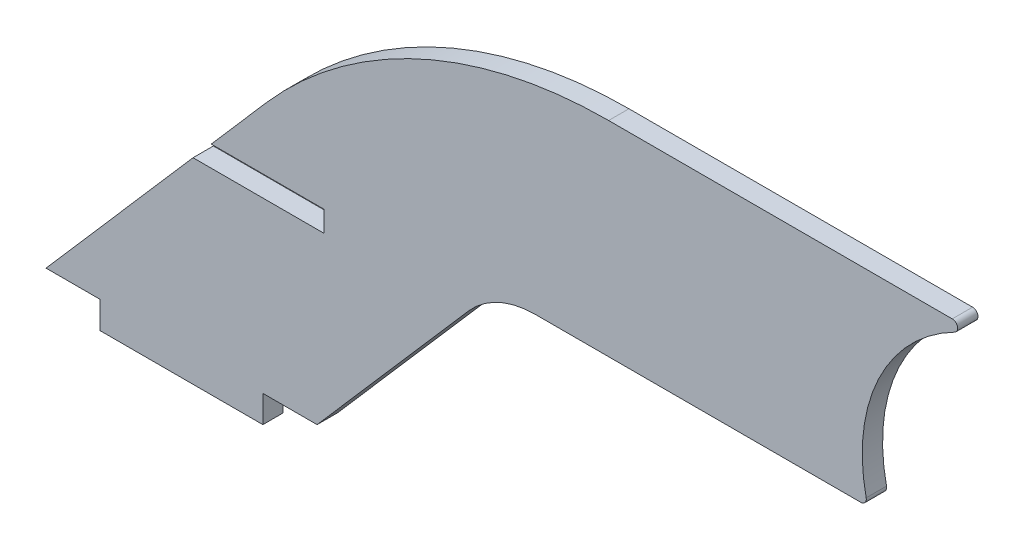
ISO-10303-21;
HEADER;
FILE_DESCRIPTION(('STEP AP214'),'2;1');
FILE_NAME('part.step','',(''),(''),'','','');
FILE_SCHEMA(('AUTOMOTIVE_DESIGN { 1 0 10303 214 1 1 1 1 }'));
ENDSEC;
DATA;
#1=APPLICATION_CONTEXT('core data for automotive mechanical design processes');
#2=APPLICATION_PROTOCOL_DEFINITION('international standard','automotive_design',2000,#1);
#3=PRODUCT_CONTEXT('',#1,'mechanical');
#4=PRODUCT('Part','Part','',(#3));
#5=PRODUCT_RELATED_PRODUCT_CATEGORY('part','',(#4));
#6=PRODUCT_DEFINITION_FORMATION('','',#4);
#7=PRODUCT_DEFINITION_CONTEXT('part definition',#1,'design');
#8=PRODUCT_DEFINITION('design','',#6,#7);
#9=PRODUCT_DEFINITION_SHAPE('','',#8);
#10=(LENGTH_UNIT() NAMED_UNIT(*) SI_UNIT(.MILLI.,.METRE.));
#11=(NAMED_UNIT(*) PLANE_ANGLE_UNIT() SI_UNIT($,.RADIAN.));
#12=(NAMED_UNIT(*) SI_UNIT($,.STERADIAN.) SOLID_ANGLE_UNIT());
#13=UNCERTAINTY_MEASURE_WITH_UNIT(LENGTH_MEASURE(1.E-05),#10,'distance_accuracy_value','');
#14=(GEOMETRIC_REPRESENTATION_CONTEXT(3) GLOBAL_UNCERTAINTY_ASSIGNED_CONTEXT((#13)) GLOBAL_UNIT_ASSIGNED_CONTEXT((#10,
#11,#12)) REPRESENTATION_CONTEXT('',''));
#15=CARTESIAN_POINT('',(0.,0.,0.));
#16=DIRECTION('',(0.,0.,1.));
#17=DIRECTION('',(1.,0.,0.));
#18=AXIS2_PLACEMENT_3D('',#15,#16,#17);
#19=CARTESIAN_POINT('',(-13.3722671470838,11.6243344854956,3.));
#20=DIRECTION('',(-0.754709580222773,0.656059028990506,0.));
#21=DIRECTION('',(-0.656059028990506,-0.754709580222773,0.));
#22=AXIS2_PLACEMENT_3D('',#19,#20,#21);
#23=PLANE('',#22);
#24=DIRECTION('',(0.,0.,-1.));
#25=VECTOR('',#24,1.);
#26=CARTESIAN_POINT('',(4.37480012836689,32.04,3.));
#27=LINE('',#26,#25);
#28=CARTESIAN_POINT('',(4.37480012836689,32.04,3.));
#29=VERTEX_POINT('',#28);
#30=CARTESIAN_POINT('',(4.37480012836689,32.04,0.));
#31=VERTEX_POINT('',#30);
#32=EDGE_CURVE('E187',#29,#31,#27,.T.);
#33=ORIENTED_EDGE('',*,*,#32,.F.);
#34=DIRECTION('',(0.656059028990506,0.754709580222773,0.));
#35=VECTOR('',#34,1.);
#36=CARTESIAN_POINT('',(-13.3722671470838,11.6243344854956,3.));
#37=LINE('',#36,#35);
#38=CARTESIAN_POINT('',(12.4528395649979,41.3327213601858,3.));
#39=VERTEX_POINT('',#38);
#40=EDGE_CURVE('E304',#29,#39,#37,.T.);
#41=ORIENTED_EDGE('',*,*,#40,.T.);
#42=DIRECTION('',(0.,0.,-1.));
#43=VECTOR('',#42,1.);
#44=CARTESIAN_POINT('',(12.4528395649979,41.3327213601858,3.));
#45=LINE('',#44,#43);
#46=CARTESIAN_POINT('',(12.4528395649979,41.3327213601858,0.));
#47=VERTEX_POINT('',#46);
#48=EDGE_CURVE('E230',#39,#47,#45,.T.);
#49=ORIENTED_EDGE('',*,*,#48,.T.);
#50=DIRECTION('',(0.656059028990506,0.754709580222773,0.));
#51=VECTOR('',#50,1.);
#52=CARTESIAN_POINT('',(-13.3722671470838,11.6243344854956,0.));
#53=LINE('',#52,#51);
#54=EDGE_CURVE('E208',#31,#47,#53,.T.);
#55=ORIENTED_EDGE('',*,*,#54,.F.);
#56=EDGE_LOOP('',(#33,#41,#49,#55));
#57=FACE_BOUND('',#56,.T.);
#58=ADVANCED_FACE('F40',(#57),#23,.T.);
#59=CARTESIAN_POINT('',(9.41119487211756,-8.18102688933583,3.));
#60=DIRECTION('',(0.754709580222773,-0.656059028990505,0.));
#61=DIRECTION('',(0.656059028990506,0.754709580222774,0.));
#62=AXIS2_PLACEMENT_3D('',#59,#60,#61);
#63=PLANE('',#62);
#64=DIRECTION('',(-0.656059028990506,-0.754709580222774,0.));
#65=VECTOR('',#64,1.);
#66=CARTESIAN_POINT('',(9.41119487211756,-8.18102688933583,0.));
#67=LINE('',#66,#65);
#68=CARTESIAN_POINT('',(42.3541724835962,29.7155337946984,0.));
#69=VERTEX_POINT('',#68);
#70=CARTESIAN_POINT('',(20.,4.,0.));
#71=VERTEX_POINT('',#70);
#72=EDGE_CURVE('E183',#69,#71,#67,.T.);
#73=ORIENTED_EDGE('',*,*,#72,.F.);
#74=DIRECTION('',(0.,0.,-1.));
#75=VECTOR('',#74,1.);
#76=CARTESIAN_POINT('',(42.3541724835962,29.7155337946984,3.));
#77=LINE('',#76,#75);
#78=CARTESIAN_POINT('',(42.3541724835962,29.7155337946984,3.));
#79=VERTEX_POINT('',#78);
#80=EDGE_CURVE('E48',#79,#69,#77,.T.);
#81=ORIENTED_EDGE('',*,*,#80,.F.);
#82=DIRECTION('',(-0.656059028990506,-0.754709580222774,0.));
#83=VECTOR('',#82,1.);
#84=CARTESIAN_POINT('',(9.41119487211756,-8.18102688933583,3.));
#85=LINE('',#84,#83);
#86=CARTESIAN_POINT('',(20.,4.,3.));
#87=VERTEX_POINT('',#86);
#88=EDGE_CURVE('E221',#79,#87,#85,.T.);
#89=ORIENTED_EDGE('',*,*,#88,.T.);
#90=DIRECTION('',(0.,0.,-1.));
#91=VECTOR('',#90,1.);
#92=CARTESIAN_POINT('',(20.,4.,3.));
#93=LINE('',#92,#91);
#94=EDGE_CURVE('E116',#87,#71,#93,.T.);
#95=ORIENTED_EDGE('',*,*,#94,.T.);
#96=EDGE_LOOP('',(#73,#81,#89,#95));
#97=FACE_BOUND('',#96,.T.);
#98=ADVANCED_FACE('F42',(#97),#63,.T.);
#99=CARTESIAN_POINT('',(52.1653970264923,21.1867664178219,3.));
#100=DIRECTION('',(0.,0.,-1.));
#101=DIRECTION('',(-1.,0.,0.));
#102=AXIS2_PLACEMENT_3D('',#99,#100,#101);
#103=CYLINDRICAL_SURFACE('',#102,13.);
#104=CARTESIAN_POINT('',(52.1653970264923,21.1867664178219,0.));
#105=DIRECTION('',(0.,0.,1.));
#106=DIRECTION('',(1.,0.,0.));
#107=AXIS2_PLACEMENT_3D('',#104,#105,#106);
#108=CIRCLE('',#107,13.);
#109=CARTESIAN_POINT('',(52.1653970264923,34.1867664178219,0.));
#110=VERTEX_POINT('',#109);
#111=EDGE_CURVE('E186',#69,#110,#108,.F.);
#112=ORIENTED_EDGE('',*,*,#111,.T.);
#113=DIRECTION('',(0.,0.,-1.));
#114=VECTOR('',#113,1.);
#115=CARTESIAN_POINT('',(52.1653970264923,34.1867664178219,3.));
#116=LINE('',#115,#114);
#117=CARTESIAN_POINT('',(52.1653970264923,34.1867664178219,3.));
#118=VERTEX_POINT('',#117);
#119=EDGE_CURVE('E243',#118,#110,#116,.T.);
#120=ORIENTED_EDGE('',*,*,#119,.F.);
#121=CARTESIAN_POINT('',(52.1653970264923,21.1867664178219,3.));
#122=DIRECTION('',(0.,0.,1.));
#123=DIRECTION('',(1.,0.,0.));
#124=AXIS2_PLACEMENT_3D('',#121,#122,#123);
#125=CIRCLE('',#124,13.);
#126=EDGE_CURVE('E248',#79,#118,#125,.F.);
#127=ORIENTED_EDGE('',*,*,#126,.F.);
#128=ORIENTED_EDGE('',*,*,#80,.T.);
#129=EDGE_LOOP('',(#112,#120,#127,#128));
#130=FACE_BOUND('',#129,.T.);
#131=ADVANCED_FACE('F246',(#130),#103,.F.);
#132=CARTESIAN_POINT('',(0.,34.1867664178219,3.));
#133=DIRECTION('',(0.,-1.,0.));
#134=DIRECTION('',(1.,0.,0.));
#135=AXIS2_PLACEMENT_3D('',#132,#133,#134);
#136=PLANE('',#135);
#137=DIRECTION('',(-1.,0.,0.));
#138=VECTOR('',#137,1.);
#139=CARTESIAN_POINT('',(0.,34.1867664178219,0.));
#140=LINE('',#139,#138);
#141=CARTESIAN_POINT('',(100.240955704569,34.1867664178219,0.));
#142=VERTEX_POINT('',#141);
#143=EDGE_CURVE('E190',#142,#110,#140,.T.);
#144=ORIENTED_EDGE('',*,*,#143,.F.);
#145=DIRECTION('',(0.,0.,-1.));
#146=VECTOR('',#145,1.);
#147=CARTESIAN_POINT('',(100.240955704569,34.1867664178219,3.));
#148=LINE('',#147,#146);
#149=CARTESIAN_POINT('',(100.240955704569,34.1867664178219,3.));
#150=VERTEX_POINT('',#149);
#151=EDGE_CURVE('E241',#150,#142,#148,.T.);
#152=ORIENTED_EDGE('',*,*,#151,.F.);
#153=DIRECTION('',(-1.,0.,0.));
#154=VECTOR('',#153,1.);
#155=CARTESIAN_POINT('',(0.,34.1867664178219,3.));
#156=LINE('',#155,#154);
#157=EDGE_CURVE('E320',#150,#118,#156,.T.);
#158=ORIENTED_EDGE('',*,*,#157,.T.);
#159=ORIENTED_EDGE('',*,*,#119,.T.);
#160=EDGE_LOOP('',(#144,#152,#158,#159));
#161=FACE_BOUND('',#160,.T.);
#162=ADVANCED_FACE('F259',(#161),#136,.T.);
#163=CARTESIAN_POINT('',(100.240955704569,34.9867664178219,3.));
#164=DIRECTION('',(0.,0.,-1.));
#165=DIRECTION('',(-1.,0.,0.));
#166=AXIS2_PLACEMENT_3D('',#163,#164,#165);
#167=CYLINDRICAL_SURFACE('',#166,0.80000000000001);
#168=CARTESIAN_POINT('',(100.240955704569,34.9867664178219,0.));
#169=DIRECTION('',(0.,0.,1.));
#170=DIRECTION('',(1.,0.,0.));
#171=AXIS2_PLACEMENT_3D('',#168,#169,#170);
#172=CIRCLE('',#171,0.80000000000001);
#173=CARTESIAN_POINT('',(101.022385069884,35.158137789479,0.));
#174=VERTEX_POINT('',#173);
#175=EDGE_CURVE('E193',#174,#142,#172,.F.);
#176=ORIENTED_EDGE('',*,*,#175,.F.);
#177=DIRECTION('',(0.,0.,-1.));
#178=VECTOR('',#177,1.);
#179=CARTESIAN_POINT('',(101.022385069884,35.158137789479,3.));
#180=LINE('',#179,#178);
#181=CARTESIAN_POINT('',(101.022385069884,35.158137789479,3.));
#182=VERTEX_POINT('',#181);
#183=EDGE_CURVE('E239',#182,#174,#180,.T.);
#184=ORIENTED_EDGE('',*,*,#183,.F.);
#185=CARTESIAN_POINT('',(100.240955704569,34.9867664178219,3.));
#186=DIRECTION('',(0.,0.,1.));
#187=DIRECTION('',(1.,0.,0.));
#188=AXIS2_PLACEMENT_3D('',#185,#186,#187);
#189=CIRCLE('',#188,0.80000000000001);
#190=EDGE_CURVE('E317',#182,#150,#189,.F.);
#191=ORIENTED_EDGE('',*,*,#190,.T.);
#192=ORIENTED_EDGE('',*,*,#151,.T.);
#193=EDGE_LOOP('',(#176,#184,#191,#192));
#194=FACE_BOUND('',#193,.T.);
#195=ADVANCED_FACE('F374',(#194),#167,.T.);
#196=CARTESIAN_POINT('',(125.534640711315,40.5337981602553,3.));
#197=DIRECTION('',(0.,0.,-1.));
#198=DIRECTION('',(-1.,0.,0.));
#199=AXIS2_PLACEMENT_3D('',#196,#197,#198);
#200=CYLINDRICAL_SURFACE('',#199,25.0947883245268);
#201=CARTESIAN_POINT('',(125.534640711315,40.5337981602553,0.));
#202=DIRECTION('',(0.,0.,1.));
#203=DIRECTION('',(1.,0.,0.));
#204=AXIS2_PLACEMENT_3D('',#201,#202,#203);
#205=CIRCLE('',#204,25.0947883245268);
#206=CARTESIAN_POINT('',(114.085991202061,62.8648712528557,0.));
#207=VERTEX_POINT('',#206);
#208=EDGE_CURVE('E196',#207,#174,#205,.T.);
#209=ORIENTED_EDGE('',*,*,#208,.F.);
#210=DIRECTION('',(0.,0.,-1.));
#211=VECTOR('',#210,1.);
#212=CARTESIAN_POINT('',(114.085991202061,62.8648712528557,3.));
#213=LINE('',#212,#211);
#214=CARTESIAN_POINT('',(114.085991202061,62.8648712528557,3.));
#215=VERTEX_POINT('',#214);
#216=EDGE_CURVE('E237',#215,#207,#213,.T.);
#217=ORIENTED_EDGE('',*,*,#216,.F.);
#218=CARTESIAN_POINT('',(125.534640711315,40.5337981602553,3.));
#219=DIRECTION('',(0.,0.,1.));
#220=DIRECTION('',(1.,0.,0.));
#221=AXIS2_PLACEMENT_3D('',#218,#219,#220);
#222=CIRCLE('',#221,25.0947883245268);
#223=EDGE_CURVE('E314',#215,#182,#222,.T.);
#224=ORIENTED_EDGE('',*,*,#223,.T.);
#225=ORIENTED_EDGE('',*,*,#183,.T.);
#226=EDGE_LOOP('',(#209,#217,#224,#225));
#227=FACE_BOUND('',#226,.T.);
#228=ADVANCED_FACE('F370',(#227),#200,.F.);
#229=CARTESIAN_POINT('',(113.721018224845,63.5767664178219,3.));
#230=DIRECTION('',(0.,0.,-1.));
#231=DIRECTION('',(-1.,0.,0.));
#232=AXIS2_PLACEMENT_3D('',#229,#230,#231);
#233=CYLINDRICAL_SURFACE('',#232,0.799999999999995);
#234=CARTESIAN_POINT('',(113.721018224845,63.5767664178219,0.));
#235=DIRECTION('',(0.,0.,1.));
#236=DIRECTION('',(1.,0.,0.));
#237=AXIS2_PLACEMENT_3D('',#234,#235,#236);
#238=CIRCLE('',#237,0.799999999999995);
#239=CARTESIAN_POINT('',(113.721018224845,64.3767664178219,0.));
#240=VERTEX_POINT('',#239);
#241=EDGE_CURVE('E199',#240,#207,#238,.F.);
#242=ORIENTED_EDGE('',*,*,#241,.F.);
#243=DIRECTION('',(0.,0.,-1.));
#244=VECTOR('',#243,1.);
#245=CARTESIAN_POINT('',(113.721018224845,64.3767664178219,3.));
#246=LINE('',#245,#244);
#247=CARTESIAN_POINT('',(113.721018224845,64.3767664178219,3.));
#248=VERTEX_POINT('',#247);
#249=EDGE_CURVE('E235',#248,#240,#246,.T.);
#250=ORIENTED_EDGE('',*,*,#249,.F.);
#251=CARTESIAN_POINT('',(113.721018224845,63.5767664178219,3.));
#252=DIRECTION('',(0.,0.,1.));
#253=DIRECTION('',(1.,0.,0.));
#254=AXIS2_PLACEMENT_3D('',#251,#252,#253);
#255=CIRCLE('',#254,0.799999999999995);
#256=EDGE_CURVE('E311',#248,#215,#255,.F.);
#257=ORIENTED_EDGE('',*,*,#256,.T.);
#258=ORIENTED_EDGE('',*,*,#216,.T.);
#259=EDGE_LOOP('',(#242,#250,#257,#258));
#260=FACE_BOUND('',#259,.T.);
#261=ADVANCED_FACE('F366',(#260),#233,.T.);
#262=CARTESIAN_POINT('',(0.,64.3767664178219,3.));
#263=DIRECTION('',(0.,1.,0.));
#264=DIRECTION('',(-1.,0.,0.));
#265=AXIS2_PLACEMENT_3D('',#262,#263,#264);
#266=PLANE('',#265);
#267=DIRECTION('',(1.,0.,0.));
#268=VECTOR('',#267,1.);
#269=CARTESIAN_POINT('',(0.,64.3767664178219,0.));
#270=LINE('',#269,#268);
#271=CARTESIAN_POINT('',(63.0183814399237,64.3767664178219,0.));
#272=VERTEX_POINT('',#271);
#273=EDGE_CURVE('E202',#272,#240,#270,.T.);
#274=ORIENTED_EDGE('',*,*,#273,.F.);
#275=DIRECTION('',(0.,0.,-1.));
#276=VECTOR('',#275,1.);
#277=CARTESIAN_POINT('',(63.0183814399237,64.3767664178219,3.));
#278=LINE('',#277,#276);
#279=CARTESIAN_POINT('',(63.0183814399237,64.3767664178219,3.));
#280=VERTEX_POINT('',#279);
#281=EDGE_CURVE('E233',#280,#272,#278,.T.);
#282=ORIENTED_EDGE('',*,*,#281,.F.);
#283=DIRECTION('',(1.,0.,0.));
#284=VECTOR('',#283,1.);
#285=CARTESIAN_POINT('',(0.,64.3767664178219,3.));
#286=LINE('',#285,#284);
#287=EDGE_CURVE('E308',#280,#248,#286,.T.);
#288=ORIENTED_EDGE('',*,*,#287,.T.);
#289=ORIENTED_EDGE('',*,*,#249,.T.);
#290=EDGE_LOOP('',(#274,#282,#288,#289));
#291=FACE_BOUND('',#290,.T.);
#292=ADVANCED_FACE('F278',(#291),#266,.T.);
#293=CARTESIAN_POINT('',(63.0183814399237,-2.62323358217814,3.));
#294=DIRECTION('',(0.,0.,-1.));
#295=DIRECTION('',(-1.,0.,0.));
#296=AXIS2_PLACEMENT_3D('',#293,#294,#295);
#297=CYLINDRICAL_SURFACE('',#296,67.);
#298=CARTESIAN_POINT('',(63.0183814399237,-2.62323358217814,0.));
#299=DIRECTION('',(0.,0.,1.));
#300=DIRECTION('',(1.,0.,0.));
#301=AXIS2_PLACEMENT_3D('',#298,#299,#300);
#302=CIRCLE('',#301,67.);
#303=EDGE_CURVE('E205',#272,#47,#302,.T.);
#304=ORIENTED_EDGE('',*,*,#303,.T.);
#305=ORIENTED_EDGE('',*,*,#48,.F.);
#306=CARTESIAN_POINT('',(63.0183814399237,-2.62323358217814,3.));
#307=DIRECTION('',(0.,0.,1.));
#308=DIRECTION('',(1.,0.,0.));
#309=AXIS2_PLACEMENT_3D('',#306,#307,#308);
#310=CIRCLE('',#309,67.);
#311=EDGE_CURVE('E305',#280,#39,#310,.T.);
#312=ORIENTED_EDGE('',*,*,#311,.F.);
#313=ORIENTED_EDGE('',*,*,#281,.T.);
#314=EDGE_LOOP('',(#304,#305,#312,#313));
#315=FACE_BOUND('',#314,.T.);
#316=ADVANCED_FACE('F270',(#315),#297,.T.);
#317=DIRECTION('',(0.,0.,1.));
#318=VECTOR('',#317,1.);
#319=CARTESIAN_POINT('',(1.69739697589292,28.96,3.));
#320=LINE('',#319,#318);
#321=CARTESIAN_POINT('',(1.69739697589293,28.96,0.));
#322=VERTEX_POINT('',#321);
#323=CARTESIAN_POINT('',(1.69739697589293,28.96,3.));
#324=VERTEX_POINT('',#323);
#325=EDGE_CURVE('E285',#322,#324,#320,.T.);
#326=ORIENTED_EDGE('',*,*,#325,.F.);
#327=CARTESIAN_POINT('',(-20.,4.,0.));
#328=VERTEX_POINT('',#327);
#329=EDGE_CURVE('E209',#328,#322,#53,.T.);
#330=ORIENTED_EDGE('',*,*,#329,.F.);
#331=DIRECTION('',(0.,0.,-1.));
#332=VECTOR('',#331,1.);
#333=CARTESIAN_POINT('',(-20.,4.,3.));
#334=LINE('',#333,#332);
#335=CARTESIAN_POINT('',(-20.,4.,3.));
#336=VERTEX_POINT('',#335);
#337=EDGE_CURVE('E228',#336,#328,#334,.T.);
#338=ORIENTED_EDGE('',*,*,#337,.F.);
#339=EDGE_CURVE('E288',#336,#324,#37,.T.);
#340=ORIENTED_EDGE('',*,*,#339,.T.);
#341=EDGE_LOOP('',(#326,#330,#338,#340));
#342=FACE_BOUND('',#341,.T.);
#343=ADVANCED_FACE('F262',(#342),#23,.T.);
#344=CARTESIAN_POINT('',(0.,4.,3.));
#345=DIRECTION('',(0.,1.,0.));
#346=DIRECTION('',(-1.,0.,0.));
#347=AXIS2_PLACEMENT_3D('',#344,#345,#346);
#348=PLANE('',#347);
#349=DIRECTION('',(1.,0.,0.));
#350=VECTOR('',#349,1.);
#351=CARTESIAN_POINT('',(0.,4.,0.));
#352=LINE('',#351,#350);
#353=CARTESIAN_POINT('',(-12.,4.,0.));
#354=VERTEX_POINT('',#353);
#355=EDGE_CURVE('E212',#328,#354,#352,.T.);
#356=ORIENTED_EDGE('',*,*,#355,.T.);
#357=DIRECTION('',(0.,0.,-1.));
#358=VECTOR('',#357,1.);
#359=CARTESIAN_POINT('',(-12.,4.,3.));
#360=LINE('',#359,#358);
#361=CARTESIAN_POINT('',(-12.,4.,3.));
#362=VERTEX_POINT('',#361);
#363=EDGE_CURVE('E225',#362,#354,#360,.T.);
#364=ORIENTED_EDGE('',*,*,#363,.F.);
#365=DIRECTION('',(1.,0.,0.));
#366=VECTOR('',#365,1.);
#367=CARTESIAN_POINT('',(0.,4.,3.));
#368=LINE('',#367,#366);
#369=EDGE_CURVE('E300',#336,#362,#368,.T.);
#370=ORIENTED_EDGE('',*,*,#369,.F.);
#371=ORIENTED_EDGE('',*,*,#337,.T.);
#372=EDGE_LOOP('',(#356,#364,#370,#371));
#373=FACE_BOUND('',#372,.T.);
#374=ADVANCED_FACE('F269',(#373),#348,.F.);
#375=CARTESIAN_POINT('',(-12.,0.,3.));
#376=DIRECTION('',(1.,0.,0.));
#377=DIRECTION('',(0.,1.,0.));
#378=AXIS2_PLACEMENT_3D('',#375,#376,#377);
#379=PLANE('',#378);
#380=DIRECTION('',(0.,-1.,0.));
#381=VECTOR('',#380,1.);
#382=CARTESIAN_POINT('',(-12.,0.,0.));
#383=LINE('',#382,#381);
#384=CARTESIAN_POINT('',(-12.,0.,0.));
#385=VERTEX_POINT('',#384);
#386=EDGE_CURVE('E214',#354,#385,#383,.T.);
#387=ORIENTED_EDGE('',*,*,#386,.T.);
#388=DIRECTION('',(0.,0.,-1.));
#389=VECTOR('',#388,1.);
#390=CARTESIAN_POINT('',(-12.,0.,3.));
#391=LINE('',#390,#389);
#392=CARTESIAN_POINT('',(-12.,0.,3.));
#393=VERTEX_POINT('',#392);
#394=EDGE_CURVE('E175',#393,#385,#391,.T.);
#395=ORIENTED_EDGE('',*,*,#394,.F.);
#396=DIRECTION('',(0.,-1.,0.));
#397=VECTOR('',#396,1.);
#398=CARTESIAN_POINT('',(-12.,0.,3.));
#399=LINE('',#398,#397);
#400=EDGE_CURVE('E162',#362,#393,#399,.T.);
#401=ORIENTED_EDGE('',*,*,#400,.F.);
#402=ORIENTED_EDGE('',*,*,#363,.T.);
#403=EDGE_LOOP('',(#387,#395,#401,#402));
#404=FACE_BOUND('',#403,.T.);
#405=ADVANCED_FACE('F276',(#404),#379,.F.);
#406=CARTESIAN_POINT('',(0.,0.,3.));
#407=DIRECTION('',(0.,1.,0.));
#408=DIRECTION('',(0.,0.,1.));
#409=AXIS2_PLACEMENT_3D('',#406,#407,#408);
#410=PLANE('',#409);
#411=DIRECTION('',(1.,0.,0.));
#412=VECTOR('',#411,1.);
#413=CARTESIAN_POINT('',(0.,0.,0.));
#414=LINE('',#413,#412);
#415=CARTESIAN_POINT('',(12.,0.,0.));
#416=VERTEX_POINT('',#415);
#417=EDGE_CURVE('E171',#385,#416,#414,.T.);
#418=ORIENTED_EDGE('',*,*,#417,.T.);
#419=DIRECTION('',(0.,0.,-1.));
#420=VECTOR('',#419,1.);
#421=CARTESIAN_POINT('',(12.,0.,3.));
#422=LINE('',#421,#420);
#423=CARTESIAN_POINT('',(12.,0.,3.));
#424=VERTEX_POINT('',#423);
#425=EDGE_CURVE('E168',#424,#416,#422,.T.);
#426=ORIENTED_EDGE('',*,*,#425,.F.);
#427=DIRECTION('',(1.,0.,0.));
#428=VECTOR('',#427,1.);
#429=CARTESIAN_POINT('',(0.,0.,3.));
#430=LINE('',#429,#428);
#431=EDGE_CURVE('E155',#393,#424,#430,.T.);
#432=ORIENTED_EDGE('',*,*,#431,.F.);
#433=ORIENTED_EDGE('',*,*,#394,.T.);
#434=EDGE_LOOP('',(#418,#426,#432,#433));
#435=FACE_BOUND('',#434,.T.);
#436=ADVANCED_FACE('F169',(#435),#410,.F.);
#437=CARTESIAN_POINT('',(12.,0.,3.));
#438=DIRECTION('',(1.,0.,0.));
#439=DIRECTION('',(0.,1.,0.));
#440=AXIS2_PLACEMENT_3D('',#437,#438,#439);
#441=PLANE('',#440);
#442=DIRECTION('',(0.,-1.,0.));
#443=VECTOR('',#442,1.);
#444=CARTESIAN_POINT('',(12.,0.,0.));
#445=LINE('',#444,#443);
#446=CARTESIAN_POINT('',(12.,4.,0.));
#447=VERTEX_POINT('',#446);
#448=EDGE_CURVE('E217',#447,#416,#445,.T.);
#449=ORIENTED_EDGE('',*,*,#448,.F.);
#450=DIRECTION('',(0.,0.,-1.));
#451=VECTOR('',#450,1.);
#452=CARTESIAN_POINT('',(12.,4.,3.));
#453=LINE('',#452,#451);
#454=CARTESIAN_POINT('',(12.,4.,3.));
#455=VERTEX_POINT('',#454);
#456=EDGE_CURVE('E176',#455,#447,#453,.T.);
#457=ORIENTED_EDGE('',*,*,#456,.F.);
#458=DIRECTION('',(0.,-1.,0.));
#459=VECTOR('',#458,1.);
#460=CARTESIAN_POINT('',(12.,0.,3.));
#461=LINE('',#460,#459);
#462=EDGE_CURVE('E160',#455,#424,#461,.T.);
#463=ORIENTED_EDGE('',*,*,#462,.T.);
#464=ORIENTED_EDGE('',*,*,#425,.T.);
#465=EDGE_LOOP('',(#449,#457,#463,#464));
#466=FACE_BOUND('',#465,.T.);
#467=ADVANCED_FACE('F178',(#466),#441,.T.);
#468=CARTESIAN_POINT('',(0.,4.,3.));
#469=DIRECTION('',(0.,1.,0.));
#470=DIRECTION('',(-1.,0.,0.));
#471=AXIS2_PLACEMENT_3D('',#468,#469,#470);
#472=PLANE('',#471);
#473=DIRECTION('',(1.,0.,0.));
#474=VECTOR('',#473,1.);
#475=CARTESIAN_POINT('',(0.,4.,0.));
#476=LINE('',#475,#474);
#477=EDGE_CURVE('E219',#447,#71,#476,.T.);
#478=ORIENTED_EDGE('',*,*,#477,.T.);
#479=ORIENTED_EDGE('',*,*,#94,.F.);
#480=DIRECTION('',(1.,0.,0.));
#481=VECTOR('',#480,1.);
#482=CARTESIAN_POINT('',(0.,4.,3.));
#483=LINE('',#482,#481);
#484=EDGE_CURVE('E64',#455,#87,#483,.T.);
#485=ORIENTED_EDGE('',*,*,#484,.F.);
#486=ORIENTED_EDGE('',*,*,#456,.T.);
#487=EDGE_LOOP('',(#478,#479,#485,#486));
#488=FACE_BOUND('',#487,.T.);
#489=ADVANCED_FACE('F434',(#488),#472,.F.);
#490=CARTESIAN_POINT('',(0.,0.,3.));
#491=DIRECTION('',(0.,0.,1.));
#492=DIRECTION('',(1.,0.,0.));
#493=AXIS2_PLACEMENT_3D('',#490,#491,#492);
#494=PLANE('',#493);
#495=DIRECTION('',(-1.,0.,0.));
#496=VECTOR('',#495,1.);
#497=CARTESIAN_POINT('',(21.,32.04,3.));
#498=LINE('',#497,#496);
#499=CARTESIAN_POINT('',(21.,32.04,3.));
#500=VERTEX_POINT('',#499);
#501=EDGE_CURVE('E331',#500,#29,#498,.T.);
#502=ORIENTED_EDGE('',*,*,#501,.F.);
#503=DIRECTION('',(0.,1.,0.));
#504=VECTOR('',#503,1.);
#505=CARTESIAN_POINT('',(21.,28.96,3.));
#506=LINE('',#505,#504);
#507=CARTESIAN_POINT('',(21.,28.96,3.));
#508=VERTEX_POINT('',#507);
#509=EDGE_CURVE('E336',#508,#500,#506,.T.);
#510=ORIENTED_EDGE('',*,*,#509,.F.);
#511=DIRECTION('',(1.,0.,0.));
#512=VECTOR('',#511,1.);
#513=CARTESIAN_POINT('',(-10.5413350567153,28.96,3.));
#514=LINE('',#513,#512);
#515=EDGE_CURVE('E339',#324,#508,#514,.T.);
#516=ORIENTED_EDGE('',*,*,#515,.F.);
#517=ORIENTED_EDGE('',*,*,#339,.F.);
#518=ORIENTED_EDGE('',*,*,#369,.T.);
#519=ORIENTED_EDGE('',*,*,#400,.T.);
#520=ORIENTED_EDGE('',*,*,#431,.T.);
#521=ORIENTED_EDGE('',*,*,#462,.F.);
#522=ORIENTED_EDGE('',*,*,#484,.T.);
#523=ORIENTED_EDGE('',*,*,#88,.F.);
#524=ORIENTED_EDGE('',*,*,#126,.T.);
#525=ORIENTED_EDGE('',*,*,#157,.F.);
#526=ORIENTED_EDGE('',*,*,#190,.F.);
#527=ORIENTED_EDGE('',*,*,#223,.F.);
#528=ORIENTED_EDGE('',*,*,#256,.F.);
#529=ORIENTED_EDGE('',*,*,#287,.F.);
#530=ORIENTED_EDGE('',*,*,#311,.T.);
#531=ORIENTED_EDGE('',*,*,#40,.F.);
#532=EDGE_LOOP('',(#502,#510,#516,#517,#518,#519,#520,#521,#522,#523,#524,#525,#526,#527,#528,
#529,#530,#531));
#533=FACE_BOUND('',#532,.T.);
#534=ADVANCED_FACE('F158',(#533),#494,.T.);
#535=CARTESIAN_POINT('',(0.,0.,0.));
#536=DIRECTION('',(0.,0.,1.));
#537=DIRECTION('',(1.,0.,0.));
#538=AXIS2_PLACEMENT_3D('',#535,#536,#537);
#539=PLANE('',#538);
#540=DIRECTION('',(0.,-1.,0.));
#541=VECTOR('',#540,1.);
#542=CARTESIAN_POINT('',(21.,28.96,0.));
#543=LINE('',#542,#541);
#544=CARTESIAN_POINT('',(21.,32.04,0.));
#545=VERTEX_POINT('',#544);
#546=CARTESIAN_POINT('',(21.,28.96,0.));
#547=VERTEX_POINT('',#546);
#548=EDGE_CURVE('E328',#545,#547,#543,.T.);
#549=ORIENTED_EDGE('',*,*,#548,.F.);
#550=DIRECTION('',(-1.,0.,0.));
#551=VECTOR('',#550,1.);
#552=CARTESIAN_POINT('',(0.,32.04,0.));
#553=LINE('',#552,#551);
#554=EDGE_CURVE('E11',#545,#31,#553,.T.);
#555=ORIENTED_EDGE('',*,*,#554,.T.);
#556=ORIENTED_EDGE('',*,*,#54,.T.);
#557=ORIENTED_EDGE('',*,*,#303,.F.);
#558=ORIENTED_EDGE('',*,*,#273,.T.);
#559=ORIENTED_EDGE('',*,*,#241,.T.);
#560=ORIENTED_EDGE('',*,*,#208,.T.);
#561=ORIENTED_EDGE('',*,*,#175,.T.);
#562=ORIENTED_EDGE('',*,*,#143,.T.);
#563=ORIENTED_EDGE('',*,*,#111,.F.);
#564=ORIENTED_EDGE('',*,*,#72,.T.);
#565=ORIENTED_EDGE('',*,*,#477,.F.);
#566=ORIENTED_EDGE('',*,*,#448,.T.);
#567=ORIENTED_EDGE('',*,*,#417,.F.);
#568=ORIENTED_EDGE('',*,*,#386,.F.);
#569=ORIENTED_EDGE('',*,*,#355,.F.);
#570=ORIENTED_EDGE('',*,*,#329,.T.);
#571=DIRECTION('',(-1.,0.,0.));
#572=VECTOR('',#571,1.);
#573=CARTESIAN_POINT('',(-10.5413350567153,28.96,0.));
#574=LINE('',#573,#572);
#575=EDGE_CURVE('E292',#547,#322,#574,.T.);
#576=ORIENTED_EDGE('',*,*,#575,.F.);
#577=EDGE_LOOP('',(#549,#555,#556,#557,#558,#559,#560,#561,#562,#563,#564,#565,#566,#567,#568,
#569,#570,#576));
#578=FACE_BOUND('',#577,.T.);
#579=ADVANCED_FACE('F251',(#578),#539,.F.);
#580=CARTESIAN_POINT('',(21.,32.04,-31.6913587143242));
#581=DIRECTION('',(0.,1.,0.));
#582=DIRECTION('',(0.,0.,1.));
#583=AXIS2_PLACEMENT_3D('',#580,#581,#582);
#584=PLANE('',#583);
#585=ORIENTED_EDGE('',*,*,#32,.T.);
#586=ORIENTED_EDGE('',*,*,#554,.F.);
#587=DIRECTION('',(0.,0.,1.));
#588=VECTOR('',#587,1.);
#589=CARTESIAN_POINT('',(21.,32.04,-31.6913587143242));
#590=LINE('',#589,#588);
#591=EDGE_CURVE('E330',#545,#500,#590,.T.);
#592=ORIENTED_EDGE('',*,*,#591,.T.);
#593=ORIENTED_EDGE('',*,*,#501,.T.);
#594=EDGE_LOOP('',(#585,#586,#592,#593));
#595=FACE_BOUND('',#594,.T.);
#596=ADVANCED_FACE('F355',(#595),#584,.F.);
#597=CARTESIAN_POINT('',(21.,28.96,-31.6913587143242));
#598=DIRECTION('',(1.,0.,0.));
#599=DIRECTION('',(0.,0.,-1.));
#600=AXIS2_PLACEMENT_3D('',#597,#598,#599);
#601=PLANE('',#600);
#602=ORIENTED_EDGE('',*,*,#548,.T.);
#603=DIRECTION('',(0.,0.,1.));
#604=VECTOR('',#603,1.);
#605=CARTESIAN_POINT('',(21.,28.96,-31.6913587143242));
#606=LINE('',#605,#604);
#607=EDGE_CURVE('E55',#547,#508,#606,.T.);
#608=ORIENTED_EDGE('',*,*,#607,.T.);
#609=ORIENTED_EDGE('',*,*,#509,.T.);
#610=ORIENTED_EDGE('',*,*,#591,.F.);
#611=EDGE_LOOP('',(#602,#608,#609,#610));
#612=FACE_BOUND('',#611,.T.);
#613=ADVANCED_FACE('F343',(#612),#601,.F.);
#614=CARTESIAN_POINT('',(-10.5413350567153,28.96,-31.6913587143242));
#615=DIRECTION('',(0.,-1.,0.));
#616=DIRECTION('',(0.,0.,-1.));
#617=AXIS2_PLACEMENT_3D('',#614,#615,#616);
#618=PLANE('',#617);
#619=ORIENTED_EDGE('',*,*,#325,.T.);
#620=ORIENTED_EDGE('',*,*,#515,.T.);
#621=ORIENTED_EDGE('',*,*,#607,.F.);
#622=ORIENTED_EDGE('',*,*,#575,.T.);
#623=EDGE_LOOP('',(#619,#620,#621,#622));
#624=FACE_BOUND('',#623,.T.);
#625=ADVANCED_FACE('F475',(#624),#618,.F.);
#626=CLOSED_SHELL('',(#58,#98,#131,#162,#195,#228,#261,#292,#316,#343,#374,#405,#436,#467,#489,
#534,#579,#596,#613,#625));
#627=MANIFOLD_SOLID_BREP('B2',#626);
#628=ADVANCED_BREP_SHAPE_REPRESENTATION('',(#18,#627),#14);
#629=SHAPE_DEFINITION_REPRESENTATION(#9,#628);
ENDSEC;
END-ISO-10303-21;
